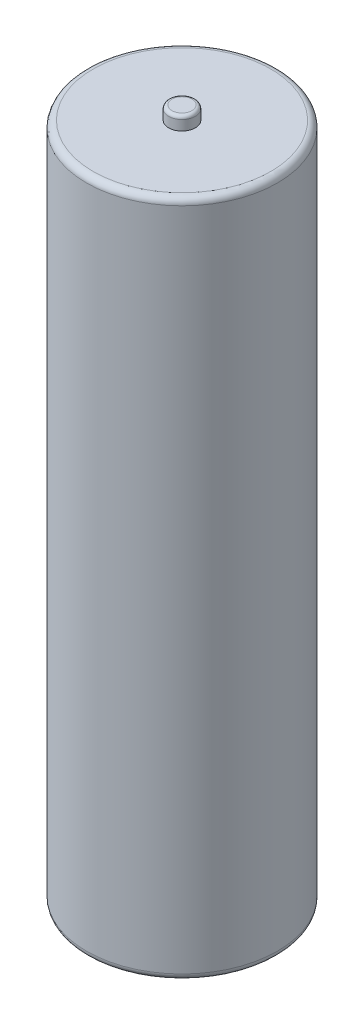
ISO-10303-21;
HEADER;
FILE_DESCRIPTION(('STEP AP214'),'2;1');
FILE_NAME('part.step','',(''),(''),'','','');
FILE_SCHEMA(('AUTOMOTIVE_DESIGN { 1 0 10303 214 1 1 1 1 }'));
ENDSEC;
DATA;
#1=APPLICATION_CONTEXT('core data for automotive mechanical design processes');
#2=APPLICATION_PROTOCOL_DEFINITION('international standard','automotive_design',2000,#1);
#3=PRODUCT_CONTEXT('',#1,'mechanical');
#4=PRODUCT('Part','Part','',(#3));
#5=PRODUCT_RELATED_PRODUCT_CATEGORY('part','',(#4));
#6=PRODUCT_DEFINITION_FORMATION('','',#4);
#7=PRODUCT_DEFINITION_CONTEXT('part definition',#1,'design');
#8=PRODUCT_DEFINITION('design','',#6,#7);
#9=PRODUCT_DEFINITION_SHAPE('','',#8);
#10=(LENGTH_UNIT() NAMED_UNIT(*) SI_UNIT(.MILLI.,.METRE.));
#11=(NAMED_UNIT(*) PLANE_ANGLE_UNIT() SI_UNIT($,.RADIAN.));
#12=(NAMED_UNIT(*) SI_UNIT($,.STERADIAN.) SOLID_ANGLE_UNIT());
#13=UNCERTAINTY_MEASURE_WITH_UNIT(LENGTH_MEASURE(1.E-05),#10,'distance_accuracy_value','');
#14=(GEOMETRIC_REPRESENTATION_CONTEXT(3) GLOBAL_UNCERTAINTY_ASSIGNED_CONTEXT((#13)) GLOBAL_UNIT_ASSIGNED_CONTEXT((#10,
#11,#12)) REPRESENTATION_CONTEXT('',''));
#15=CARTESIAN_POINT('',(0.,0.,0.));
#16=DIRECTION('',(0.,0.,1.));
#17=DIRECTION('',(1.,0.,0.));
#18=AXIS2_PLACEMENT_3D('',#15,#16,#17);
#19=CARTESIAN_POINT('',(0.,51.,0.));
#20=DIRECTION('',(0.,1.,0.));
#21=DIRECTION('',(0.,0.,1.));
#22=AXIS2_PLACEMENT_3D('',#19,#20,#21);
#23=PLANE('',#22);
#24=CARTESIAN_POINT('',(0.,51.,0.));
#25=DIRECTION('',(0.,1.,0.));
#26=DIRECTION('',(0.,0.,1.));
#27=AXIS2_PLACEMENT_3D('',#24,#25,#26);
#28=CIRCLE('',#27,6.675);
#29=CARTESIAN_POINT('',(0.,51.,6.675));
#30=VERTEX_POINT('',#29);
#31=EDGE_CURVE('E55',#30,#30,#28,.T.);
#32=ORIENTED_EDGE('',*,*,#31,.T.);
#33=EDGE_LOOP('',(#32));
#34=FACE_BOUND('',#33,.T.);
#35=CARTESIAN_POINT('',(0.,51.,0.));
#36=DIRECTION('',(0.,1.,0.));
#37=DIRECTION('',(0.,0.,1.));
#38=AXIS2_PLACEMENT_3D('',#35,#36,#37);
#39=CIRCLE('',#38,1.);
#40=CARTESIAN_POINT('',(0.,51.,1.));
#41=VERTEX_POINT('',#40);
#42=EDGE_CURVE('E58',#41,#41,#39,.T.);
#43=ORIENTED_EDGE('',*,*,#42,.F.);
#44=EDGE_LOOP('',(#43));
#45=FACE_BOUND('',#44,.T.);
#46=ADVANCED_FACE('F32',(#34,#45),#23,.T.);
#47=CARTESIAN_POINT('',(0.,51.,0.));
#48=DIRECTION('',(0.,-1.,0.));
#49=DIRECTION('',(0.,0.,-1.));
#50=AXIS2_PLACEMENT_3D('',#47,#48,#49);
#51=CYLINDRICAL_SURFACE('',#50,7.175);
#52=CARTESIAN_POINT('',(0.,50.5,0.));
#53=DIRECTION('',(0.,1.,0.));
#54=DIRECTION('',(0.,0.,1.));
#55=AXIS2_PLACEMENT_3D('',#52,#53,#54);
#56=CIRCLE('',#55,7.175);
#57=CARTESIAN_POINT('',(0.,50.5,7.175));
#58=VERTEX_POINT('',#57);
#59=EDGE_CURVE('E47',#58,#58,#56,.F.);
#60=ORIENTED_EDGE('',*,*,#59,.T.);
#61=EDGE_LOOP('',(#60));
#62=FACE_BOUND('',#61,.T.);
#63=CARTESIAN_POINT('',(0.,0.5,0.));
#64=DIRECTION('',(0.,1.,0.));
#65=DIRECTION('',(0.,0.,1.));
#66=AXIS2_PLACEMENT_3D('',#63,#64,#65);
#67=CIRCLE('',#66,7.175);
#68=CARTESIAN_POINT('',(0.,0.5,7.175));
#69=VERTEX_POINT('',#68);
#70=EDGE_CURVE('E52',#69,#69,#67,.T.);
#71=ORIENTED_EDGE('',*,*,#70,.T.);
#72=EDGE_LOOP('',(#71));
#73=FACE_BOUND('',#72,.T.);
#74=ADVANCED_FACE('F65',(#62,#73),#51,.T.);
#75=CARTESIAN_POINT('',(0.,0.,0.));
#76=DIRECTION('',(0.,1.,0.));
#77=DIRECTION('',(0.,0.,1.));
#78=AXIS2_PLACEMENT_3D('',#75,#76,#77);
#79=PLANE('',#78);
#80=CARTESIAN_POINT('',(0.,0.,0.));
#81=DIRECTION('',(0.,1.,0.));
#82=DIRECTION('',(0.,0.,1.));
#83=AXIS2_PLACEMENT_3D('',#80,#81,#82);
#84=CIRCLE('',#83,6.675);
#85=CARTESIAN_POINT('',(0.,0.,6.675));
#86=VERTEX_POINT('',#85);
#87=EDGE_CURVE('E43',#86,#86,#84,.F.);
#88=ORIENTED_EDGE('',*,*,#87,.T.);
#89=EDGE_LOOP('',(#88));
#90=FACE_BOUND('',#89,.T.);
#91=ADVANCED_FACE('F71',(#90),#79,.F.);
#92=CARTESIAN_POINT('',(0.,50.5,0.));
#93=DIRECTION('',(0.,1.,0.));
#94=DIRECTION('',(0.,0.,1.));
#95=AXIS2_PLACEMENT_3D('',#92,#93,#94);
#96=TOROIDAL_SURFACE('',#95,6.675,0.5);
#97=ORIENTED_EDGE('',*,*,#59,.F.);
#98=EDGE_LOOP('',(#97));
#99=FACE_BOUND('',#98,.T.);
#100=ORIENTED_EDGE('',*,*,#31,.F.);
#101=EDGE_LOOP('',(#100));
#102=FACE_BOUND('',#101,.T.);
#103=ADVANCED_FACE('F78',(#99,#102),#96,.T.);
#104=CARTESIAN_POINT('',(0.,0.5,0.));
#105=DIRECTION('',(0.,1.,0.));
#106=DIRECTION('',(0.,0.,1.));
#107=AXIS2_PLACEMENT_3D('',#104,#105,#106);
#108=TOROIDAL_SURFACE('',#107,6.675,0.5);
#109=ORIENTED_EDGE('',*,*,#87,.F.);
#110=EDGE_LOOP('',(#109));
#111=FACE_BOUND('',#110,.T.);
#112=ORIENTED_EDGE('',*,*,#70,.F.);
#113=EDGE_LOOP('',(#112));
#114=FACE_BOUND('',#113,.T.);
#115=ADVANCED_FACE('F82',(#111,#114),#108,.T.);
#116=CARTESIAN_POINT('',(0.,52.,0.));
#117=DIRECTION('',(0.,-1.,0.));
#118=DIRECTION('',(0.,0.,-1.));
#119=AXIS2_PLACEMENT_3D('',#116,#117,#118);
#120=CYLINDRICAL_SURFACE('',#119,1.);
#121=CARTESIAN_POINT('',(0.,51.75,0.));
#122=DIRECTION('',(0.,1.,0.));
#123=DIRECTION('',(0.,0.,1.));
#124=AXIS2_PLACEMENT_3D('',#121,#122,#123);
#125=CIRCLE('',#124,1.);
#126=CARTESIAN_POINT('',(0.,51.75,1.));
#127=VERTEX_POINT('',#126);
#128=EDGE_CURVE('E10',#127,#127,#125,.F.);
#129=ORIENTED_EDGE('',*,*,#128,.T.);
#130=EDGE_LOOP('',(#129));
#131=FACE_BOUND('',#130,.T.);
#132=ORIENTED_EDGE('',*,*,#42,.T.);
#133=EDGE_LOOP('',(#132));
#134=FACE_BOUND('',#133,.T.);
#135=ADVANCED_FACE('F62',(#131,#134),#120,.T.);
#136=CARTESIAN_POINT('',(0.,52.,0.));
#137=DIRECTION('',(0.,1.,0.));
#138=DIRECTION('',(0.,0.,1.));
#139=AXIS2_PLACEMENT_3D('',#136,#137,#138);
#140=PLANE('',#139);
#141=CARTESIAN_POINT('',(0.,52.,0.));
#142=DIRECTION('',(0.,1.,0.));
#143=DIRECTION('',(0.,0.,1.));
#144=AXIS2_PLACEMENT_3D('',#141,#142,#143);
#145=CIRCLE('',#144,0.75);
#146=CARTESIAN_POINT('',(0.,52.,0.75));
#147=VERTEX_POINT('',#146);
#148=EDGE_CURVE('E39',#147,#147,#145,.T.);
#149=ORIENTED_EDGE('',*,*,#148,.T.);
#150=EDGE_LOOP('',(#149));
#151=FACE_BOUND('',#150,.T.);
#152=ADVANCED_FACE('F89',(#151),#140,.T.);
#153=CARTESIAN_POINT('',(0.,51.75,0.));
#154=DIRECTION('',(0.,1.,0.));
#155=DIRECTION('',(0.,0.,1.));
#156=AXIS2_PLACEMENT_3D('',#153,#154,#155);
#157=TOROIDAL_SURFACE('',#156,0.75,0.25);
#158=ORIENTED_EDGE('',*,*,#128,.F.);
#159=EDGE_LOOP('',(#158));
#160=FACE_BOUND('',#159,.T.);
#161=ORIENTED_EDGE('',*,*,#148,.F.);
#162=EDGE_LOOP('',(#161));
#163=FACE_BOUND('',#162,.T.);
#164=ADVANCED_FACE('F34',(#160,#163),#157,.T.);
#165=CLOSED_SHELL('',(#46,#74,#91,#103,#115,#135,#152,#164));
#166=MANIFOLD_SOLID_BREP('B2',#165);
#167=ADVANCED_BREP_SHAPE_REPRESENTATION('',(#18,#166),#14);
#168=SHAPE_DEFINITION_REPRESENTATION(#9,#167);
ENDSEC;
END-ISO-10303-21;
